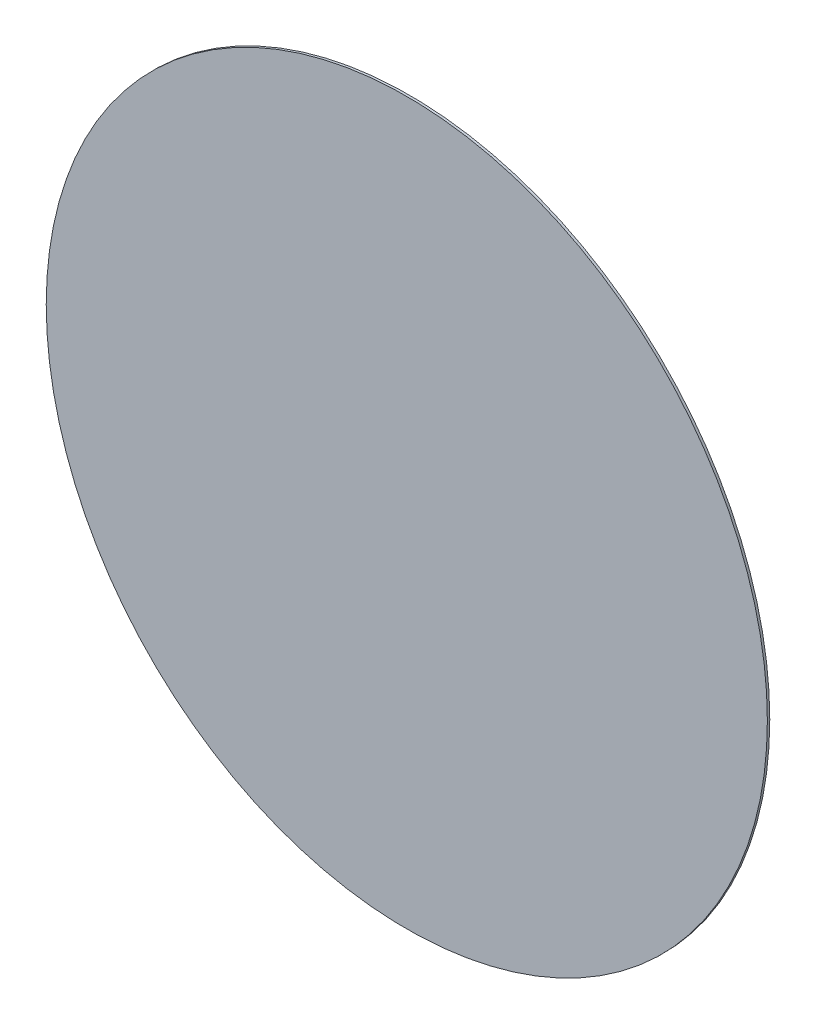
ISO-10303-21;
HEADER;
FILE_DESCRIPTION(('STEP AP214'),'2;1');
FILE_NAME('part.step','',(''),(''),'','','');
FILE_SCHEMA(('AUTOMOTIVE_DESIGN { 1 0 10303 214 1 1 1 1 }'));
ENDSEC;
DATA;
#1=APPLICATION_CONTEXT('core data for automotive mechanical design processes');
#2=APPLICATION_PROTOCOL_DEFINITION('international standard','automotive_design',2000,#1);
#3=PRODUCT_CONTEXT('',#1,'mechanical');
#4=PRODUCT('Part','Part','',(#3));
#5=PRODUCT_RELATED_PRODUCT_CATEGORY('part','',(#4));
#6=PRODUCT_DEFINITION_FORMATION('','',#4);
#7=PRODUCT_DEFINITION_CONTEXT('part definition',#1,'design');
#8=PRODUCT_DEFINITION('design','',#6,#7);
#9=PRODUCT_DEFINITION_SHAPE('','',#8);
#10=(LENGTH_UNIT() NAMED_UNIT(*) SI_UNIT(.MILLI.,.METRE.));
#11=(NAMED_UNIT(*) PLANE_ANGLE_UNIT() SI_UNIT($,.RADIAN.));
#12=(NAMED_UNIT(*) SI_UNIT($,.STERADIAN.) SOLID_ANGLE_UNIT());
#13=UNCERTAINTY_MEASURE_WITH_UNIT(LENGTH_MEASURE(1.E-05),#10,'distance_accuracy_value','');
#14=(GEOMETRIC_REPRESENTATION_CONTEXT(3) GLOBAL_UNCERTAINTY_ASSIGNED_CONTEXT((#13)) GLOBAL_UNIT_ASSIGNED_CONTEXT((#10,
#11,#12)) REPRESENTATION_CONTEXT('',''));
#15=CARTESIAN_POINT('',(0.,0.,0.));
#16=DIRECTION('',(0.,0.,1.));
#17=DIRECTION('',(1.,0.,0.));
#18=AXIS2_PLACEMENT_3D('',#15,#16,#17);
#19=CARTESIAN_POINT('',(0.,0.,0.));
#20=DIRECTION('',(0.,0.,1.));
#21=DIRECTION('',(-1.,0.,0.));
#22=AXIS2_PLACEMENT_3D('',#19,#20,#21);
#23=CYLINDRICAL_SURFACE('',#22,0.15);
#24=CARTESIAN_POINT('',(0.,0.,0.001));
#25=DIRECTION('',(0.,0.,1.));
#26=DIRECTION('',(-1.,0.,0.));
#27=AXIS2_PLACEMENT_3D('',#24,#25,#26);
#28=CIRCLE('',#27,0.15);
#29=CARTESIAN_POINT('',(0.15,0.,0.001));
#30=VERTEX_POINT('',#29);
#31=EDGE_CURVE('E11',#30,#30,#28,.T.);
#32=ORIENTED_EDGE('',*,*,#31,.F.);
#33=DIRECTION('',(0.,0.,-1.));
#34=VECTOR('',#33,1.);
#35=CARTESIAN_POINT('',(0.15,0.,0.));
#36=LINE('',#35,#34);
#37=CARTESIAN_POINT('',(0.15,0.,0.));
#38=VERTEX_POINT('',#37);
#39=EDGE_CURVE('E24',#30,#38,#36,.T.);
#40=ORIENTED_EDGE('',*,*,#39,.T.);
#41=CARTESIAN_POINT('',(0.,0.,0.));
#42=DIRECTION('',(0.,0.,-1.));
#43=DIRECTION('',(-1.,0.,0.));
#44=AXIS2_PLACEMENT_3D('',#41,#42,#43);
#45=CIRCLE('',#44,0.15);
#46=EDGE_CURVE('E33',#38,#38,#45,.T.);
#47=ORIENTED_EDGE('',*,*,#46,.F.);
#48=ORIENTED_EDGE('',*,*,#39,.F.);
#49=EDGE_LOOP('',(#32,#40,#47,#48));
#50=FACE_BOUND('',#49,.T.);
#51=ADVANCED_FACE('F17',(#50),#23,.T.);
#52=CARTESIAN_POINT('',(0.,0.,0.));
#53=DIRECTION('',(0.,0.,1.));
#54=DIRECTION('',(1.,0.,0.));
#55=AXIS2_PLACEMENT_3D('',#52,#53,#54);
#56=PLANE('',#55);
#57=ORIENTED_EDGE('',*,*,#46,.T.);
#58=EDGE_LOOP('',(#57));
#59=FACE_BOUND('',#58,.T.);
#60=ADVANCED_FACE('F35',(#59),#56,.F.);
#61=CARTESIAN_POINT('',(0.,0.,0.001));
#62=DIRECTION('',(0.,0.,1.));
#63=DIRECTION('',(1.,0.,0.));
#64=AXIS2_PLACEMENT_3D('',#61,#62,#63);
#65=PLANE('',#64);
#66=ORIENTED_EDGE('',*,*,#31,.T.);
#67=EDGE_LOOP('',(#66));
#68=FACE_BOUND('',#67,.T.);
#69=ADVANCED_FACE('F38',(#68),#65,.T.);
#70=CLOSED_SHELL('',(#51,#60,#69));
#71=MANIFOLD_SOLID_BREP('B1',#70);
#72=ADVANCED_BREP_SHAPE_REPRESENTATION('',(#18,#71),#14);
#73=SHAPE_DEFINITION_REPRESENTATION(#9,#72);
ENDSEC;
END-ISO-10303-21;
